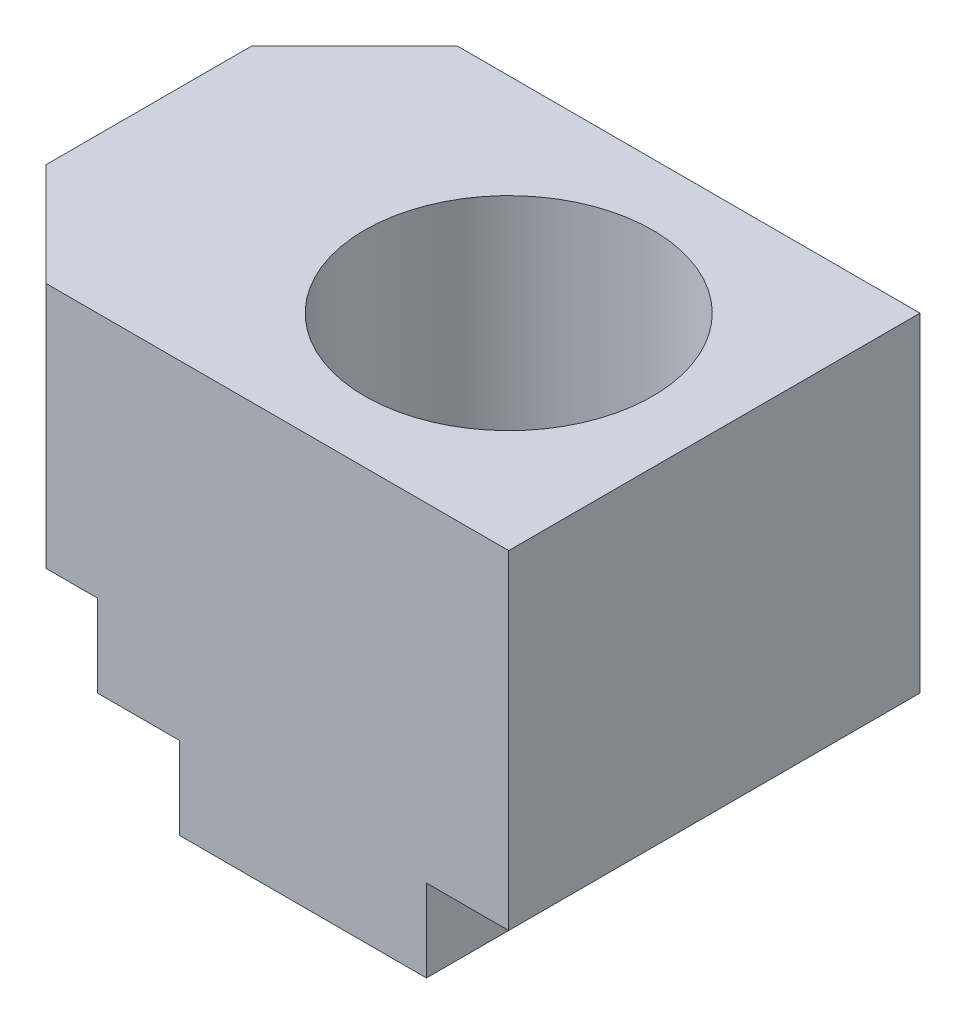
ISO-10303-21;
HEADER;
FILE_DESCRIPTION(('STEP AP214'),'2;1');
FILE_NAME('part.step','',(''),(''),'','','');
FILE_SCHEMA(('AUTOMOTIVE_DESIGN { 1 0 10303 214 1 1 1 1 }'));
ENDSEC;
DATA;
#1=APPLICATION_CONTEXT('core data for automotive mechanical design processes');
#2=APPLICATION_PROTOCOL_DEFINITION('international standard','automotive_design',2000,#1);
#3=PRODUCT_CONTEXT('',#1,'mechanical');
#4=PRODUCT('Part','Part','',(#3));
#5=PRODUCT_RELATED_PRODUCT_CATEGORY('part','',(#4));
#6=PRODUCT_DEFINITION_FORMATION('','',#4);
#7=PRODUCT_DEFINITION_CONTEXT('part definition',#1,'design');
#8=PRODUCT_DEFINITION('design','',#6,#7);
#9=PRODUCT_DEFINITION_SHAPE('','',#8);
#10=(LENGTH_UNIT() NAMED_UNIT(*) SI_UNIT(.MILLI.,.METRE.));
#11=(NAMED_UNIT(*) PLANE_ANGLE_UNIT() SI_UNIT($,.RADIAN.));
#12=(NAMED_UNIT(*) SI_UNIT($,.STERADIAN.) SOLID_ANGLE_UNIT());
#13=UNCERTAINTY_MEASURE_WITH_UNIT(LENGTH_MEASURE(1.E-05),#10,'distance_accuracy_value','');
#14=(GEOMETRIC_REPRESENTATION_CONTEXT(3) GLOBAL_UNCERTAINTY_ASSIGNED_CONTEXT((#13)) GLOBAL_UNIT_ASSIGNED_CONTEXT((#10,
#11,#12)) REPRESENTATION_CONTEXT('',''));
#15=CARTESIAN_POINT('',(0.,0.,0.));
#16=DIRECTION('',(0.,0.,1.));
#17=DIRECTION('',(1.,0.,0.));
#18=AXIS2_PLACEMENT_3D('',#15,#16,#17);
#19=CARTESIAN_POINT('',(-14.375589066918,-19.881903864279,20.));
#20=DIRECTION('',(0.,1.,0.));
#21=DIRECTION('',(-1.,0.,0.));
#22=AXIS2_PLACEMENT_3D('',#19,#20,#21);
#23=CYLINDRICAL_SURFACE('',#22,8.00000000000001);
#24=CARTESIAN_POINT('',(-14.375589066918,-19.881903864279,20.));
#25=DIRECTION('',(0.,1.,0.));
#26=DIRECTION('',(-1.,0.,0.));
#27=AXIS2_PLACEMENT_3D('',#24,#25,#26);
#28=CIRCLE('',#27,8.00000000000001);
#29=CARTESIAN_POINT('',(-22.375589066918,-19.881903864279,20.));
#30=VERTEX_POINT('',#29);
#31=EDGE_CURVE('E135',#30,#30,#28,.T.);
#32=ORIENTED_EDGE('',*,*,#31,.F.);
#33=EDGE_LOOP('',(#32));
#34=FACE_BOUND('',#33,.T.);
#35=CARTESIAN_POINT('',(-14.375589066918,0.118096135721023,20.));
#36=DIRECTION('',(0.,1.,0.));
#37=DIRECTION('',(-1.,0.,0.));
#38=AXIS2_PLACEMENT_3D('',#35,#36,#37);
#39=CIRCLE('',#38,8.00000000000001);
#40=CARTESIAN_POINT('',(-22.375589066918,0.118096135721022,20.));
#41=VERTEX_POINT('',#40);
#42=EDGE_CURVE('E35',#41,#41,#39,.F.);
#43=ORIENTED_EDGE('',*,*,#42,.F.);
#44=EDGE_LOOP('',(#43));
#45=FACE_BOUND('',#44,.T.);
#46=ADVANCED_FACE('F31',(#34,#45),#23,.F.);
#47=CARTESIAN_POINT('',(-49.375589066918,20.118096135721,40.));
#48=DIRECTION('',(1.,0.,0.));
#49=DIRECTION('',(0.,0.,-1.));
#50=AXIS2_PLACEMENT_3D('',#47,#48,#49);
#51=PLANE('',#50);
#52=DIRECTION('',(0.,0.,1.));
#53=VECTOR('',#52,1.);
#54=CARTESIAN_POINT('',(-49.375589066918,-3.88190386427897,0.));
#55=LINE('',#54,#53);
#56=CARTESIAN_POINT('',(-49.375589066918,-3.88190386427897,10.));
#57=VERTEX_POINT('',#56);
#58=CARTESIAN_POINT('',(-49.375589066918,-3.88190386427897,30.));
#59=VERTEX_POINT('',#58);
#60=EDGE_CURVE('E158',#57,#59,#55,.T.);
#61=ORIENTED_EDGE('',*,*,#60,.T.);
#62=DIRECTION('',(0.,1.,0.));
#63=VECTOR('',#62,1.);
#64=CARTESIAN_POINT('',(-49.375589066918,-19.881903864279,30.));
#65=LINE('',#64,#63);
#66=CARTESIAN_POINT('',(-49.375589066918,20.118096135721,30.));
#67=VERTEX_POINT('',#66);
#68=EDGE_CURVE('E47',#59,#67,#65,.T.);
#69=ORIENTED_EDGE('',*,*,#68,.T.);
#70=DIRECTION('',(0.,0.,-1.));
#71=VECTOR('',#70,1.);
#72=CARTESIAN_POINT('',(-49.375589066918,20.118096135721,40.));
#73=LINE('',#72,#71);
#74=CARTESIAN_POINT('',(-49.375589066918,20.118096135721,10.));
#75=VERTEX_POINT('',#74);
#76=EDGE_CURVE('E134',#67,#75,#73,.T.);
#77=ORIENTED_EDGE('',*,*,#76,.T.);
#78=DIRECTION('',(0.,1.,0.));
#79=VECTOR('',#78,1.);
#80=CARTESIAN_POINT('',(-49.375589066918,-19.881903864279,10.));
#81=LINE('',#80,#79);
#82=EDGE_CURVE('E229',#57,#75,#81,.T.);
#83=ORIENTED_EDGE('',*,*,#82,.F.);
#84=EDGE_LOOP('',(#61,#69,#77,#83));
#85=FACE_BOUND('',#84,.T.);
#86=ADVANCED_FACE('F33',(#85),#51,.F.);
#87=CARTESIAN_POINT('',(-49.375589066918,-19.881903864279,40.));
#88=DIRECTION('',(0.,1.,0.));
#89=DIRECTION('',(0.,0.,1.));
#90=AXIS2_PLACEMENT_3D('',#87,#88,#89);
#91=PLANE('',#90);
#92=ORIENTED_EDGE('',*,*,#31,.T.);
#93=EDGE_LOOP('',(#92));
#94=FACE_BOUND('',#93,.T.);
#95=DIRECTION('',(1.,0.,0.));
#96=VECTOR('',#95,1.);
#97=CARTESIAN_POINT('',(-49.375589066918,-19.881903864279,40.));
#98=LINE('',#97,#96);
#99=CARTESIAN_POINT('',(-26.375589066918,-19.881903864279,40.));
#100=VERTEX_POINT('',#99);
#101=CARTESIAN_POINT('',(-2.37558906691799,-19.881903864279,40.));
#102=VERTEX_POINT('',#101);
#103=EDGE_CURVE('E145',#100,#102,#98,.T.);
#104=ORIENTED_EDGE('',*,*,#103,.F.);
#105=DIRECTION('',(0.,0.,1.));
#106=VECTOR('',#105,1.);
#107=CARTESIAN_POINT('',(-26.375589066918,-19.881903864279,0.));
#108=LINE('',#107,#106);
#109=CARTESIAN_POINT('',(-26.375589066918,-19.881903864279,0.));
#110=VERTEX_POINT('',#109);
#111=EDGE_CURVE('E168',#110,#100,#108,.T.);
#112=ORIENTED_EDGE('',*,*,#111,.F.);
#113=DIRECTION('',(1.,0.,0.));
#114=VECTOR('',#113,1.);
#115=CARTESIAN_POINT('',(-49.375589066918,-19.881903864279,0.));
#116=LINE('',#115,#114);
#117=CARTESIAN_POINT('',(-2.37558906691799,-19.881903864279,0.));
#118=VERTEX_POINT('',#117);
#119=EDGE_CURVE('E198',#110,#118,#116,.T.);
#120=ORIENTED_EDGE('',*,*,#119,.T.);
#121=DIRECTION('',(0.,0.,1.));
#122=VECTOR('',#121,1.);
#123=CARTESIAN_POINT('',(-2.37558906691799,-19.881903864279,0.));
#124=LINE('',#123,#122);
#125=EDGE_CURVE('E195',#118,#102,#124,.T.);
#126=ORIENTED_EDGE('',*,*,#125,.T.);
#127=EDGE_LOOP('',(#104,#112,#120,#126));
#128=FACE_BOUND('',#127,.T.);
#129=ADVANCED_FACE('F218',(#94,#128),#91,.F.);
#130=CARTESIAN_POINT('',(5.62441093308201,-19.881903864279,40.));
#131=DIRECTION('',(-1.,0.,0.));
#132=DIRECTION('',(0.,-1.,0.));
#133=AXIS2_PLACEMENT_3D('',#130,#131,#132);
#134=PLANE('',#133);
#135=DIRECTION('',(0.,1.,0.));
#136=VECTOR('',#135,1.);
#137=CARTESIAN_POINT('',(5.62441093308201,-19.881903864279,40.));
#138=LINE('',#137,#136);
#139=CARTESIAN_POINT('',(5.62441093308201,-11.881903864279,40.));
#140=VERTEX_POINT('',#139);
#141=CARTESIAN_POINT('',(5.62441093308201,20.118096135721,40.));
#142=VERTEX_POINT('',#141);
#143=EDGE_CURVE('E140',#140,#142,#138,.T.);
#144=ORIENTED_EDGE('',*,*,#143,.F.);
#145=DIRECTION('',(0.,0.,1.));
#146=VECTOR('',#145,1.);
#147=CARTESIAN_POINT('',(5.62441093308201,-11.881903864279,0.));
#148=LINE('',#147,#146);
#149=CARTESIAN_POINT('',(5.62441093308201,-11.881903864279,0.));
#150=VERTEX_POINT('',#149);
#151=EDGE_CURVE('E194',#150,#140,#148,.T.);
#152=ORIENTED_EDGE('',*,*,#151,.F.);
#153=DIRECTION('',(0.,1.,0.));
#154=VECTOR('',#153,1.);
#155=CARTESIAN_POINT('',(5.62441093308201,-19.881903864279,0.));
#156=LINE('',#155,#154);
#157=CARTESIAN_POINT('',(5.62441093308201,20.118096135721,0.));
#158=VERTEX_POINT('',#157);
#159=EDGE_CURVE('E203',#150,#158,#156,.T.);
#160=ORIENTED_EDGE('',*,*,#159,.T.);
#161=DIRECTION('',(0.,0.,-1.));
#162=VECTOR('',#161,1.);
#163=CARTESIAN_POINT('',(5.62441093308201,20.118096135721,40.));
#164=LINE('',#163,#162);
#165=EDGE_CURVE('E143',#142,#158,#164,.T.);
#166=ORIENTED_EDGE('',*,*,#165,.F.);
#167=EDGE_LOOP('',(#144,#152,#160,#166));
#168=FACE_BOUND('',#167,.T.);
#169=ADVANCED_FACE('F227',(#168),#134,.F.);
#170=CARTESIAN_POINT('',(5.62441093308201,20.118096135721,40.));
#171=DIRECTION('',(0.,-1.,0.));
#172=DIRECTION('',(1.,0.,0.));
#173=AXIS2_PLACEMENT_3D('',#170,#171,#172);
#174=PLANE('',#173);
#175=CARTESIAN_POINT('',(-14.375589066918,20.118096135721,20.));
#176=DIRECTION('',(0.,1.,0.));
#177=DIRECTION('',(-1.,0.,0.));
#178=AXIS2_PLACEMENT_3D('',#175,#176,#177);
#179=CIRCLE('',#178,14.);
#180=CARTESIAN_POINT('',(-28.375589066918,20.118096135721,20.));
#181=VERTEX_POINT('',#180);
#182=EDGE_CURVE('E289',#181,#181,#179,.T.);
#183=ORIENTED_EDGE('',*,*,#182,.F.);
#184=EDGE_LOOP('',(#183));
#185=FACE_BOUND('',#184,.T.);
#186=ORIENTED_EDGE('',*,*,#76,.F.);
#187=DIRECTION('',(-0.707106781186548,0.,-0.707106781186548));
#188=VECTOR('',#187,1.);
#189=CARTESIAN_POINT('',(-49.375589066918,20.118096135721,30.));
#190=LINE('',#189,#188);
#191=CARTESIAN_POINT('',(-39.375589066918,20.118096135721,40.));
#192=VERTEX_POINT('',#191);
#193=EDGE_CURVE('E121',#192,#67,#190,.T.);
#194=ORIENTED_EDGE('',*,*,#193,.F.);
#195=DIRECTION('',(-1.,0.,0.));
#196=VECTOR('',#195,1.);
#197=CARTESIAN_POINT('',(5.62441093308201,20.118096135721,40.));
#198=LINE('',#197,#196);
#199=EDGE_CURVE('E132',#142,#192,#198,.T.);
#200=ORIENTED_EDGE('',*,*,#199,.F.);
#201=ORIENTED_EDGE('',*,*,#165,.T.);
#202=DIRECTION('',(-1.,0.,0.));
#203=VECTOR('',#202,1.);
#204=CARTESIAN_POINT('',(5.62441093308201,20.118096135721,0.));
#205=LINE('',#204,#203);
#206=CARTESIAN_POINT('',(-39.375589066918,20.118096135721,0.));
#207=VERTEX_POINT('',#206);
#208=EDGE_CURVE('E205',#158,#207,#205,.T.);
#209=ORIENTED_EDGE('',*,*,#208,.T.);
#210=DIRECTION('',(0.707106781186548,0.,-0.707106781186547));
#211=VECTOR('',#210,1.);
#212=CARTESIAN_POINT('',(-39.375589066918,20.118096135721,0.));
#213=LINE('',#212,#211);
#214=EDGE_CURVE('E228',#75,#207,#213,.T.);
#215=ORIENTED_EDGE('',*,*,#214,.F.);
#216=EDGE_LOOP('',(#186,#194,#200,#201,#209,#215));
#217=FACE_BOUND('',#216,.T.);
#218=ADVANCED_FACE('F130',(#185,#217),#174,.F.);
#219=CARTESIAN_POINT('',(-49.375589066918,-19.881903864279,40.));
#220=DIRECTION('',(0.,0.,1.));
#221=DIRECTION('',(1.,0.,0.));
#222=AXIS2_PLACEMENT_3D('',#219,#220,#221);
#223=PLANE('',#222);
#224=DIRECTION('',(0.,1.,0.));
#225=VECTOR('',#224,1.);
#226=CARTESIAN_POINT('',(-39.375589066918,-19.881903864279,40.));
#227=LINE('',#226,#225);
#228=CARTESIAN_POINT('',(-39.375589066918,-3.88190386427897,40.));
#229=VERTEX_POINT('',#228);
#230=EDGE_CURVE('E118',#229,#192,#227,.T.);
#231=ORIENTED_EDGE('',*,*,#230,.F.);
#232=DIRECTION('',(-1.,0.,0.));
#233=VECTOR('',#232,1.);
#234=CARTESIAN_POINT('',(-49.375589066918,-3.88190386427897,40.));
#235=LINE('',#234,#233);
#236=CARTESIAN_POINT('',(-34.375589066918,-3.88190386427898,40.));
#237=VERTEX_POINT('',#236);
#238=EDGE_CURVE('E242',#237,#229,#235,.T.);
#239=ORIENTED_EDGE('',*,*,#238,.F.);
#240=DIRECTION('',(0.,1.,0.));
#241=VECTOR('',#240,1.);
#242=CARTESIAN_POINT('',(-34.375589066918,-3.88190386427898,40.));
#243=LINE('',#242,#241);
#244=CARTESIAN_POINT('',(-34.375589066918,-11.881903864279,40.));
#245=VERTEX_POINT('',#244);
#246=EDGE_CURVE('E239',#245,#237,#243,.T.);
#247=ORIENTED_EDGE('',*,*,#246,.F.);
#248=DIRECTION('',(-1.,0.,0.));
#249=VECTOR('',#248,1.);
#250=CARTESIAN_POINT('',(-34.375589066918,-11.881903864279,40.));
#251=LINE('',#250,#249);
#252=CARTESIAN_POINT('',(-26.375589066918,-11.881903864279,40.));
#253=VERTEX_POINT('',#252);
#254=EDGE_CURVE('E236',#253,#245,#251,.T.);
#255=ORIENTED_EDGE('',*,*,#254,.F.);
#256=DIRECTION('',(0.,1.,0.));
#257=VECTOR('',#256,1.);
#258=CARTESIAN_POINT('',(-26.375589066918,-11.881903864279,40.));
#259=LINE('',#258,#257);
#260=EDGE_CURVE('E211',#100,#253,#259,.T.);
#261=ORIENTED_EDGE('',*,*,#260,.F.);
#262=ORIENTED_EDGE('',*,*,#103,.T.);
#263=DIRECTION('',(0.,-1.,0.));
#264=VECTOR('',#263,1.);
#265=CARTESIAN_POINT('',(-2.37558906691799,-19.881903864279,40.));
#266=LINE('',#265,#264);
#267=CARTESIAN_POINT('',(-2.37558906691799,-11.881903864279,40.));
#268=VERTEX_POINT('',#267);
#269=EDGE_CURVE('E185',#268,#102,#266,.T.);
#270=ORIENTED_EDGE('',*,*,#269,.F.);
#271=DIRECTION('',(-1.,0.,0.));
#272=VECTOR('',#271,1.);
#273=CARTESIAN_POINT('',(-2.37558906691799,-11.881903864279,40.));
#274=LINE('',#273,#272);
#275=EDGE_CURVE('E177',#140,#268,#274,.T.);
#276=ORIENTED_EDGE('',*,*,#275,.F.);
#277=ORIENTED_EDGE('',*,*,#143,.T.);
#278=ORIENTED_EDGE('',*,*,#199,.T.);
#279=EDGE_LOOP('',(#231,#239,#247,#255,#261,#262,#270,#276,#277,#278));
#280=FACE_BOUND('',#279,.T.);
#281=ADVANCED_FACE('F137',(#280),#223,.T.);
#282=CARTESIAN_POINT('',(-49.375589066918,-19.881903864279,0.));
#283=DIRECTION('',(0.,0.,1.));
#284=DIRECTION('',(1.,0.,0.));
#285=AXIS2_PLACEMENT_3D('',#282,#283,#284);
#286=PLANE('',#285);
#287=DIRECTION('',(-1.,0.,0.));
#288=VECTOR('',#287,1.);
#289=CARTESIAN_POINT('',(-49.375589066918,-3.88190386427897,0.));
#290=LINE('',#289,#288);
#291=CARTESIAN_POINT('',(-34.375589066918,-3.88190386427898,0.));
#292=VERTEX_POINT('',#291);
#293=CARTESIAN_POINT('',(-39.375589066918,-3.88190386427897,0.));
#294=VERTEX_POINT('',#293);
#295=EDGE_CURVE('E155',#292,#294,#290,.T.);
#296=ORIENTED_EDGE('',*,*,#295,.T.);
#297=DIRECTION('',(0.,1.,0.));
#298=VECTOR('',#297,1.);
#299=CARTESIAN_POINT('',(-39.375589066918,-19.881903864279,0.));
#300=LINE('',#299,#298);
#301=EDGE_CURVE('E54',#294,#207,#300,.T.);
#302=ORIENTED_EDGE('',*,*,#301,.T.);
#303=ORIENTED_EDGE('',*,*,#208,.F.);
#304=ORIENTED_EDGE('',*,*,#159,.F.);
#305=DIRECTION('',(-1.,0.,0.));
#306=VECTOR('',#305,1.);
#307=CARTESIAN_POINT('',(-2.37558906691799,-11.881903864279,0.));
#308=LINE('',#307,#306);
#309=CARTESIAN_POINT('',(-2.37558906691799,-11.881903864279,0.));
#310=VERTEX_POINT('',#309);
#311=EDGE_CURVE('E188',#150,#310,#308,.T.);
#312=ORIENTED_EDGE('',*,*,#311,.T.);
#313=DIRECTION('',(0.,-1.,0.));
#314=VECTOR('',#313,1.);
#315=CARTESIAN_POINT('',(-2.37558906691799,-19.881903864279,0.));
#316=LINE('',#315,#314);
#317=EDGE_CURVE('E191',#310,#118,#316,.T.);
#318=ORIENTED_EDGE('',*,*,#317,.T.);
#319=ORIENTED_EDGE('',*,*,#119,.F.);
#320=DIRECTION('',(0.,1.,0.));
#321=VECTOR('',#320,1.);
#322=CARTESIAN_POINT('',(-26.375589066918,-11.881903864279,0.));
#323=LINE('',#322,#321);
#324=CARTESIAN_POINT('',(-26.375589066918,-11.881903864279,0.));
#325=VERTEX_POINT('',#324);
#326=EDGE_CURVE('E221',#110,#325,#323,.T.);
#327=ORIENTED_EDGE('',*,*,#326,.T.);
#328=DIRECTION('',(-1.,0.,0.));
#329=VECTOR('',#328,1.);
#330=CARTESIAN_POINT('',(-34.375589066918,-11.881903864279,0.));
#331=LINE('',#330,#329);
#332=CARTESIAN_POINT('',(-34.375589066918,-11.881903864279,0.));
#333=VERTEX_POINT('',#332);
#334=EDGE_CURVE('E172',#325,#333,#331,.T.);
#335=ORIENTED_EDGE('',*,*,#334,.T.);
#336=DIRECTION('',(0.,1.,0.));
#337=VECTOR('',#336,1.);
#338=CARTESIAN_POINT('',(-34.375589066918,-3.88190386427898,0.));
#339=LINE('',#338,#337);
#340=EDGE_CURVE('E167',#333,#292,#339,.T.);
#341=ORIENTED_EDGE('',*,*,#340,.T.);
#342=EDGE_LOOP('',(#296,#302,#303,#304,#312,#318,#319,#327,#335,#341));
#343=FACE_BOUND('',#342,.T.);
#344=ADVANCED_FACE('F162',(#343),#286,.F.);
#345=CARTESIAN_POINT('',(-2.37558906691799,-19.881903864279,0.));
#346=DIRECTION('',(-1.,0.,0.));
#347=DIRECTION('',(0.,-1.,0.));
#348=AXIS2_PLACEMENT_3D('',#345,#346,#347);
#349=PLANE('',#348);
#350=ORIENTED_EDGE('',*,*,#269,.T.);
#351=ORIENTED_EDGE('',*,*,#125,.F.);
#352=ORIENTED_EDGE('',*,*,#317,.F.);
#353=DIRECTION('',(0.,0.,1.));
#354=VECTOR('',#353,1.);
#355=CARTESIAN_POINT('',(-2.37558906691799,-11.881903864279,0.));
#356=LINE('',#355,#354);
#357=EDGE_CURVE('E199',#310,#268,#356,.T.);
#358=ORIENTED_EDGE('',*,*,#357,.T.);
#359=EDGE_LOOP('',(#350,#351,#352,#358));
#360=FACE_BOUND('',#359,.T.);
#361=ADVANCED_FACE('F216',(#360),#349,.F.);
#362=CARTESIAN_POINT('',(-2.37558906691799,-11.881903864279,0.));
#363=DIRECTION('',(0.,1.,0.));
#364=DIRECTION('',(0.,0.,1.));
#365=AXIS2_PLACEMENT_3D('',#362,#363,#364);
#366=PLANE('',#365);
#367=ORIENTED_EDGE('',*,*,#275,.T.);
#368=ORIENTED_EDGE('',*,*,#357,.F.);
#369=ORIENTED_EDGE('',*,*,#311,.F.);
#370=ORIENTED_EDGE('',*,*,#151,.T.);
#371=EDGE_LOOP('',(#367,#368,#369,#370));
#372=FACE_BOUND('',#371,.T.);
#373=ADVANCED_FACE('F224',(#372),#366,.F.);
#374=CARTESIAN_POINT('',(-49.375589066918,-3.88190386427897,0.));
#375=DIRECTION('',(0.,1.,0.));
#376=DIRECTION('',(-1.,0.,0.));
#377=AXIS2_PLACEMENT_3D('',#374,#375,#376);
#378=PLANE('',#377);
#379=ORIENTED_EDGE('',*,*,#238,.T.);
#380=DIRECTION('',(-0.707106781186548,0.,-0.707106781186548));
#381=VECTOR('',#380,1.);
#382=CARTESIAN_POINT('',(-64.375589066918,-3.88190386427897,15.));
#383=LINE('',#382,#381);
#384=EDGE_CURVE('E11',#229,#59,#383,.T.);
#385=ORIENTED_EDGE('',*,*,#384,.T.);
#386=ORIENTED_EDGE('',*,*,#60,.F.);
#387=DIRECTION('',(0.707106781186548,0.,-0.707106781186547));
#388=VECTOR('',#387,1.);
#389=CARTESIAN_POINT('',(-44.375589066918,-3.88190386427897,5.));
#390=LINE('',#389,#388);
#391=EDGE_CURVE('E40',#57,#294,#390,.T.);
#392=ORIENTED_EDGE('',*,*,#391,.T.);
#393=ORIENTED_EDGE('',*,*,#295,.F.);
#394=DIRECTION('',(0.,0.,1.));
#395=VECTOR('',#394,1.);
#396=CARTESIAN_POINT('',(-34.375589066918,-3.88190386427898,0.));
#397=LINE('',#396,#395);
#398=EDGE_CURVE('E178',#292,#237,#397,.T.);
#399=ORIENTED_EDGE('',*,*,#398,.T.);
#400=EDGE_LOOP('',(#379,#385,#386,#392,#393,#399));
#401=FACE_BOUND('',#400,.T.);
#402=ADVANCED_FACE('F154',(#401),#378,.F.);
#403=CARTESIAN_POINT('',(-34.375589066918,-3.88190386427898,0.));
#404=DIRECTION('',(1.,0.,0.));
#405=DIRECTION('',(0.,0.,-1.));
#406=AXIS2_PLACEMENT_3D('',#403,#404,#405);
#407=PLANE('',#406);
#408=ORIENTED_EDGE('',*,*,#246,.T.);
#409=ORIENTED_EDGE('',*,*,#398,.F.);
#410=ORIENTED_EDGE('',*,*,#340,.F.);
#411=DIRECTION('',(0.,0.,1.));
#412=VECTOR('',#411,1.);
#413=CARTESIAN_POINT('',(-34.375589066918,-11.881903864279,0.));
#414=LINE('',#413,#412);
#415=EDGE_CURVE('E180',#333,#245,#414,.T.);
#416=ORIENTED_EDGE('',*,*,#415,.T.);
#417=EDGE_LOOP('',(#408,#409,#410,#416));
#418=FACE_BOUND('',#417,.T.);
#419=ADVANCED_FACE('F251',(#418),#407,.F.);
#420=CARTESIAN_POINT('',(-34.375589066918,-11.881903864279,0.));
#421=DIRECTION('',(0.,1.,0.));
#422=DIRECTION('',(0.,0.,1.));
#423=AXIS2_PLACEMENT_3D('',#420,#421,#422);
#424=PLANE('',#423);
#425=ORIENTED_EDGE('',*,*,#254,.T.);
#426=ORIENTED_EDGE('',*,*,#415,.F.);
#427=ORIENTED_EDGE('',*,*,#334,.F.);
#428=DIRECTION('',(0.,0.,1.));
#429=VECTOR('',#428,1.);
#430=CARTESIAN_POINT('',(-26.375589066918,-11.881903864279,0.));
#431=LINE('',#430,#429);
#432=EDGE_CURVE('E170',#325,#253,#431,.T.);
#433=ORIENTED_EDGE('',*,*,#432,.T.);
#434=EDGE_LOOP('',(#425,#426,#427,#433));
#435=FACE_BOUND('',#434,.T.);
#436=ADVANCED_FACE('F246',(#435),#424,.F.);
#437=CARTESIAN_POINT('',(-26.375589066918,-11.881903864279,0.));
#438=DIRECTION('',(1.,0.,0.));
#439=DIRECTION('',(0.,0.,-1.));
#440=AXIS2_PLACEMENT_3D('',#437,#438,#439);
#441=PLANE('',#440);
#442=ORIENTED_EDGE('',*,*,#260,.T.);
#443=ORIENTED_EDGE('',*,*,#432,.F.);
#444=ORIENTED_EDGE('',*,*,#326,.F.);
#445=ORIENTED_EDGE('',*,*,#111,.T.);
#446=EDGE_LOOP('',(#442,#443,#444,#445));
#447=FACE_BOUND('',#446,.T.);
#448=ADVANCED_FACE('F248',(#447),#441,.F.);
#449=CARTESIAN_POINT('',(-39.375589066918,-19.881903864279,0.));
#450=DIRECTION('',(0.707106781186547,0.,0.707106781186548));
#451=DIRECTION('',(0.707106781186548,0.,-0.707106781186547));
#452=AXIS2_PLACEMENT_3D('',#449,#450,#451);
#453=PLANE('',#452);
#454=ORIENTED_EDGE('',*,*,#82,.T.);
#455=ORIENTED_EDGE('',*,*,#214,.T.);
#456=ORIENTED_EDGE('',*,*,#301,.F.);
#457=ORIENTED_EDGE('',*,*,#391,.F.);
#458=EDGE_LOOP('',(#454,#455,#456,#457));
#459=FACE_BOUND('',#458,.T.);
#460=ADVANCED_FACE('F253',(#459),#453,.F.);
#461=CARTESIAN_POINT('',(-49.375589066918,-19.881903864279,30.));
#462=DIRECTION('',(0.707106781186548,0.,-0.707106781186548));
#463=DIRECTION('',(-0.707106781186548,0.,-0.707106781186548));
#464=AXIS2_PLACEMENT_3D('',#461,#462,#463);
#465=PLANE('',#464);
#466=ORIENTED_EDGE('',*,*,#230,.T.);
#467=ORIENTED_EDGE('',*,*,#193,.T.);
#468=ORIENTED_EDGE('',*,*,#68,.F.);
#469=ORIENTED_EDGE('',*,*,#384,.F.);
#470=EDGE_LOOP('',(#466,#467,#468,#469));
#471=FACE_BOUND('',#470,.T.);
#472=ADVANCED_FACE('F120',(#471),#465,.F.);
#473=CARTESIAN_POINT('',(-14.375589066918,0.118096135721023,20.));
#474=DIRECTION('',(0.,1.,0.));
#475=DIRECTION('',(-1.,0.,0.));
#476=AXIS2_PLACEMENT_3D('',#473,#474,#475);
#477=PLANE('',#476);
#478=CARTESIAN_POINT('',(-14.375589066918,0.118096135721023,20.));
#479=DIRECTION('',(0.,1.,0.));
#480=DIRECTION('',(-1.,0.,0.));
#481=AXIS2_PLACEMENT_3D('',#478,#479,#480);
#482=CIRCLE('',#481,14.);
#483=CARTESIAN_POINT('',(-28.375589066918,0.118096135721021,20.));
#484=VERTEX_POINT('',#483);
#485=EDGE_CURVE('E284',#484,#484,#482,.T.);
#486=ORIENTED_EDGE('',*,*,#485,.T.);
#487=EDGE_LOOP('',(#486));
#488=FACE_BOUND('',#487,.T.);
#489=ORIENTED_EDGE('',*,*,#42,.T.);
#490=EDGE_LOOP('',(#489));
#491=FACE_BOUND('',#490,.T.);
#492=ADVANCED_FACE('F260',(#488,#491),#477,.T.);
#493=CARTESIAN_POINT('',(-14.375589066918,0.118096135721023,20.));
#494=DIRECTION('',(0.,1.,0.));
#495=DIRECTION('',(-1.,0.,0.));
#496=AXIS2_PLACEMENT_3D('',#493,#494,#495);
#497=CYLINDRICAL_SURFACE('',#496,14.);
#498=ORIENTED_EDGE('',*,*,#485,.F.);
#499=EDGE_LOOP('',(#498));
#500=FACE_BOUND('',#499,.T.);
#501=ORIENTED_EDGE('',*,*,#182,.T.);
#502=EDGE_LOOP('',(#501));
#503=FACE_BOUND('',#502,.T.);
#504=ADVANCED_FACE('F273',(#500,#503),#497,.F.);
#505=CLOSED_SHELL('',(#46,#86,#129,#169,#218,#281,#344,#361,#373,#402,#419,#436,#448,#460,#472,
#492,#504));
#506=MANIFOLD_SOLID_BREP('B2',#505);
#507=ADVANCED_BREP_SHAPE_REPRESENTATION('',(#18,#506),#14);
#508=SHAPE_DEFINITION_REPRESENTATION(#9,#507);
ENDSEC;
END-ISO-10303-21;
